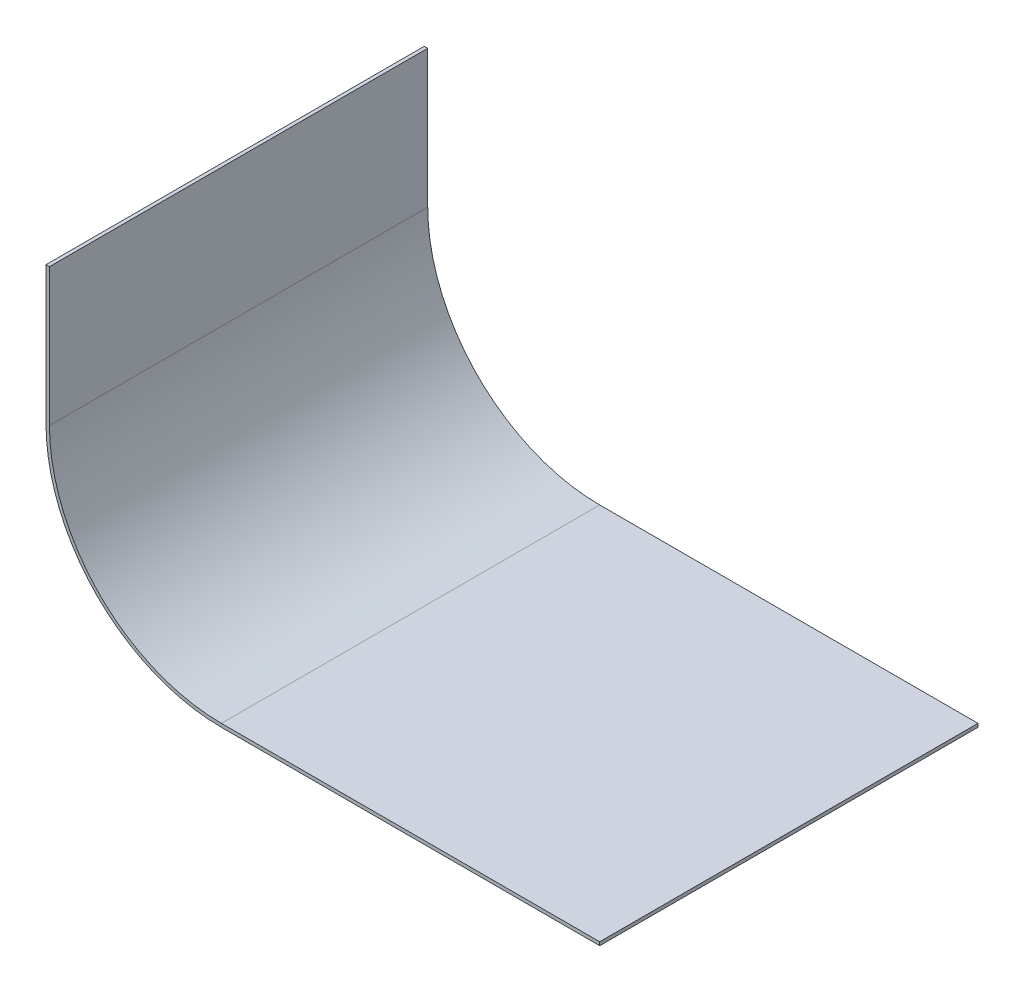
ISO-10303-21;
HEADER;
FILE_DESCRIPTION(('STEP AP214'),'2;1');
FILE_NAME('part.step','',(''),(''),'','','');
FILE_SCHEMA(('AUTOMOTIVE_DESIGN { 1 0 10303 214 1 1 1 1 }'));
ENDSEC;
DATA;
#1=APPLICATION_CONTEXT('core data for automotive mechanical design processes');
#2=APPLICATION_PROTOCOL_DEFINITION('international standard','automotive_design',2000,#1);
#3=PRODUCT_CONTEXT('',#1,'mechanical');
#4=PRODUCT('Part','Part','',(#3));
#5=PRODUCT_RELATED_PRODUCT_CATEGORY('part','',(#4));
#6=PRODUCT_DEFINITION_FORMATION('','',#4);
#7=PRODUCT_DEFINITION_CONTEXT('part definition',#1,'design');
#8=PRODUCT_DEFINITION('design','',#6,#7);
#9=PRODUCT_DEFINITION_SHAPE('','',#8);
#10=(LENGTH_UNIT() NAMED_UNIT(*) SI_UNIT(.MILLI.,.METRE.));
#11=(NAMED_UNIT(*) PLANE_ANGLE_UNIT() SI_UNIT($,.RADIAN.));
#12=(NAMED_UNIT(*) SI_UNIT($,.STERADIAN.) SOLID_ANGLE_UNIT());
#13=UNCERTAINTY_MEASURE_WITH_UNIT(LENGTH_MEASURE(1.E-05),#10,'distance_accuracy_value','');
#14=(GEOMETRIC_REPRESENTATION_CONTEXT(3) GLOBAL_UNCERTAINTY_ASSIGNED_CONTEXT((#13)) GLOBAL_UNIT_ASSIGNED_CONTEXT((#10,
#11,#12)) REPRESENTATION_CONTEXT('',''));
#15=CARTESIAN_POINT('',(0.,0.,0.));
#16=DIRECTION('',(0.,0.,1.));
#17=DIRECTION('',(1.,0.,0.));
#18=AXIS2_PLACEMENT_3D('',#15,#16,#17);
#19=CARTESIAN_POINT('',(-0.1,0.,11.));
#20=DIRECTION('',(0.,-1.,0.));
#21=DIRECTION('',(0.,0.,-1.));
#22=AXIS2_PLACEMENT_3D('',#19,#20,#21);
#23=PLANE('',#22);
#24=DIRECTION('',(-1.,0.,0.));
#25=VECTOR('',#24,1.);
#26=CARTESIAN_POINT('',(-0.1,0.,0.));
#27=LINE('',#26,#25);
#28=CARTESIAN_POINT('',(0.,0.,0.));
#29=VERTEX_POINT('',#28);
#30=CARTESIAN_POINT('',(-0.1,0.,0.));
#31=VERTEX_POINT('',#30);
#32=EDGE_CURVE('E127',#29,#31,#27,.T.);
#33=ORIENTED_EDGE('',*,*,#32,.T.);
#34=DIRECTION('',(0.,0.,-1.));
#35=VECTOR('',#34,1.);
#36=CARTESIAN_POINT('',(-0.1,0.,11.));
#37=LINE('',#36,#35);
#38=CARTESIAN_POINT('',(-0.1,0.,11.));
#39=VERTEX_POINT('',#38);
#40=EDGE_CURVE('E11',#39,#31,#37,.T.);
#41=ORIENTED_EDGE('',*,*,#40,.F.);
#42=DIRECTION('',(-1.,0.,0.));
#43=VECTOR('',#42,1.);
#44=CARTESIAN_POINT('',(-0.1,0.,11.));
#45=LINE('',#44,#43);
#46=CARTESIAN_POINT('',(0.,0.,11.));
#47=VERTEX_POINT('',#46);
#48=EDGE_CURVE('E141',#47,#39,#45,.T.);
#49=ORIENTED_EDGE('',*,*,#48,.F.);
#50=DIRECTION('',(0.,0.,-1.));
#51=VECTOR('',#50,1.);
#52=CARTESIAN_POINT('',(0.,0.,11.));
#53=LINE('',#52,#51);
#54=EDGE_CURVE('E123',#47,#29,#53,.T.);
#55=ORIENTED_EDGE('',*,*,#54,.T.);
#56=EDGE_LOOP('',(#33,#41,#49,#55));
#57=FACE_BOUND('',#56,.T.);
#58=ADVANCED_FACE('F31',(#57),#23,.F.);
#59=CARTESIAN_POINT('',(-0.1,0.,11.));
#60=DIRECTION('',(1.,0.,0.));
#61=DIRECTION('',(0.,0.,-1.));
#62=AXIS2_PLACEMENT_3D('',#59,#60,#61);
#63=PLANE('',#62);
#64=DIRECTION('',(0.,-1.,0.));
#65=VECTOR('',#64,1.);
#66=CARTESIAN_POINT('',(-0.1,0.,0.));
#67=LINE('',#66,#65);
#68=CARTESIAN_POINT('',(-0.1,-4.,0.));
#69=VERTEX_POINT('',#68);
#70=EDGE_CURVE('E130',#31,#69,#67,.T.);
#71=ORIENTED_EDGE('',*,*,#70,.T.);
#72=DIRECTION('',(0.,0.,-1.));
#73=VECTOR('',#72,1.);
#74=CARTESIAN_POINT('',(-0.1,-4.,11.));
#75=LINE('',#74,#73);
#76=CARTESIAN_POINT('',(-0.1,-4.,11.));
#77=VERTEX_POINT('',#76);
#78=EDGE_CURVE('E39',#77,#69,#75,.T.);
#79=ORIENTED_EDGE('',*,*,#78,.F.);
#80=DIRECTION('',(0.,-1.,0.));
#81=VECTOR('',#80,1.);
#82=CARTESIAN_POINT('',(-0.1,0.,11.));
#83=LINE('',#82,#81);
#84=EDGE_CURVE('E90',#39,#77,#83,.T.);
#85=ORIENTED_EDGE('',*,*,#84,.F.);
#86=ORIENTED_EDGE('',*,*,#40,.T.);
#87=EDGE_LOOP('',(#71,#79,#85,#86));
#88=FACE_BOUND('',#87,.T.);
#89=ADVANCED_FACE('F176',(#88),#63,.F.);
#90=CARTESIAN_POINT('',(5.,-4.,11.));
#91=DIRECTION('',(0.,0.,-1.));
#92=DIRECTION('',(-1.,0.,0.));
#93=AXIS2_PLACEMENT_3D('',#90,#91,#92);
#94=CYLINDRICAL_SURFACE('',#93,5.1);
#95=CARTESIAN_POINT('',(5.,-4.,0.));
#96=DIRECTION('',(0.,0.,1.));
#97=DIRECTION('',(1.,0.,0.));
#98=AXIS2_PLACEMENT_3D('',#95,#96,#97);
#99=CIRCLE('',#98,5.1);
#100=CARTESIAN_POINT('',(5.,-9.1,0.));
#101=VERTEX_POINT('',#100);
#102=EDGE_CURVE('E132',#69,#101,#99,.T.);
#103=ORIENTED_EDGE('',*,*,#102,.T.);
#104=DIRECTION('',(0.,0.,-1.));
#105=VECTOR('',#104,1.);
#106=CARTESIAN_POINT('',(5.,-9.1,11.));
#107=LINE('',#106,#105);
#108=CARTESIAN_POINT('',(5.,-9.1,11.));
#109=VERTEX_POINT('',#108);
#110=EDGE_CURVE('E148',#109,#101,#107,.T.);
#111=ORIENTED_EDGE('',*,*,#110,.F.);
#112=CARTESIAN_POINT('',(5.,-4.,11.));
#113=DIRECTION('',(0.,0.,1.));
#114=DIRECTION('',(1.,0.,0.));
#115=AXIS2_PLACEMENT_3D('',#112,#113,#114);
#116=CIRCLE('',#115,5.1);
#117=EDGE_CURVE('E156',#77,#109,#116,.T.);
#118=ORIENTED_EDGE('',*,*,#117,.F.);
#119=ORIENTED_EDGE('',*,*,#78,.T.);
#120=EDGE_LOOP('',(#103,#111,#118,#119));
#121=FACE_BOUND('',#120,.T.);
#122=ADVANCED_FACE('F154',(#121),#94,.T.);
#123=CARTESIAN_POINT('',(5.,-9.1,11.));
#124=DIRECTION('',(0.,1.,0.));
#125=DIRECTION('',(-1.,0.,0.));
#126=AXIS2_PLACEMENT_3D('',#123,#124,#125);
#127=PLANE('',#126);
#128=DIRECTION('',(1.,0.,0.));
#129=VECTOR('',#128,1.);
#130=CARTESIAN_POINT('',(5.,-9.1,0.));
#131=LINE('',#130,#129);
#132=CARTESIAN_POINT('',(16.,-9.09999999999999,0.));
#133=VERTEX_POINT('',#132);
#134=EDGE_CURVE('E134',#101,#133,#131,.T.);
#135=ORIENTED_EDGE('',*,*,#134,.T.);
#136=DIRECTION('',(0.,0.,-1.));
#137=VECTOR('',#136,1.);
#138=CARTESIAN_POINT('',(16.,-9.09999999999999,11.));
#139=LINE('',#138,#137);
#140=CARTESIAN_POINT('',(16.,-9.09999999999999,11.));
#141=VERTEX_POINT('',#140);
#142=EDGE_CURVE('E145',#141,#133,#139,.T.);
#143=ORIENTED_EDGE('',*,*,#142,.F.);
#144=DIRECTION('',(1.,0.,0.));
#145=VECTOR('',#144,1.);
#146=CARTESIAN_POINT('',(5.,-9.1,11.));
#147=LINE('',#146,#145);
#148=EDGE_CURVE('E168',#109,#141,#147,.T.);
#149=ORIENTED_EDGE('',*,*,#148,.F.);
#150=ORIENTED_EDGE('',*,*,#110,.T.);
#151=EDGE_LOOP('',(#135,#143,#149,#150));
#152=FACE_BOUND('',#151,.T.);
#153=ADVANCED_FACE('F164',(#152),#127,.F.);
#154=CARTESIAN_POINT('',(16.,-9.,11.));
#155=DIRECTION('',(-1.,0.,0.));
#156=DIRECTION('',(0.,0.,1.));
#157=AXIS2_PLACEMENT_3D('',#154,#155,#156);
#158=PLANE('',#157);
#159=DIRECTION('',(0.,1.,0.));
#160=VECTOR('',#159,1.);
#161=CARTESIAN_POINT('',(16.,-9.,0.));
#162=LINE('',#161,#160);
#163=CARTESIAN_POINT('',(16.,-9.,0.));
#164=VERTEX_POINT('',#163);
#165=EDGE_CURVE('E136',#133,#164,#162,.T.);
#166=ORIENTED_EDGE('',*,*,#165,.T.);
#167=DIRECTION('',(0.,0.,-1.));
#168=VECTOR('',#167,1.);
#169=CARTESIAN_POINT('',(16.,-9.,11.));
#170=LINE('',#169,#168);
#171=CARTESIAN_POINT('',(16.,-9.,11.));
#172=VERTEX_POINT('',#171);
#173=EDGE_CURVE('E118',#172,#164,#170,.T.);
#174=ORIENTED_EDGE('',*,*,#173,.F.);
#175=DIRECTION('',(0.,1.,0.));
#176=VECTOR('',#175,1.);
#177=CARTESIAN_POINT('',(16.,-9.,11.));
#178=LINE('',#177,#176);
#179=EDGE_CURVE('E109',#141,#172,#178,.T.);
#180=ORIENTED_EDGE('',*,*,#179,.F.);
#181=ORIENTED_EDGE('',*,*,#142,.T.);
#182=EDGE_LOOP('',(#166,#174,#180,#181));
#183=FACE_BOUND('',#182,.T.);
#184=ADVANCED_FACE('F167',(#183),#158,.F.);
#185=CARTESIAN_POINT('',(5.,-8.99999999999999,11.));
#186=DIRECTION('',(0.,-1.,0.));
#187=DIRECTION('',(1.,0.,0.));
#188=AXIS2_PLACEMENT_3D('',#185,#186,#187);
#189=PLANE('',#188);
#190=DIRECTION('',(-1.,0.,0.));
#191=VECTOR('',#190,1.);
#192=CARTESIAN_POINT('',(5.,-8.99999999999999,0.));
#193=LINE('',#192,#191);
#194=CARTESIAN_POINT('',(5.,-8.99999999999999,0.));
#195=VERTEX_POINT('',#194);
#196=EDGE_CURVE('E117',#164,#195,#193,.T.);
#197=ORIENTED_EDGE('',*,*,#196,.T.);
#198=DIRECTION('',(0.,0.,-1.));
#199=VECTOR('',#198,1.);
#200=CARTESIAN_POINT('',(5.,-8.99999999999999,11.));
#201=LINE('',#200,#199);
#202=CARTESIAN_POINT('',(5.,-8.99999999999999,11.));
#203=VERTEX_POINT('',#202);
#204=EDGE_CURVE('E114',#203,#195,#201,.T.);
#205=ORIENTED_EDGE('',*,*,#204,.F.);
#206=DIRECTION('',(-1.,0.,0.));
#207=VECTOR('',#206,1.);
#208=CARTESIAN_POINT('',(5.,-8.99999999999999,11.));
#209=LINE('',#208,#207);
#210=EDGE_CURVE('E103',#172,#203,#209,.T.);
#211=ORIENTED_EDGE('',*,*,#210,.F.);
#212=ORIENTED_EDGE('',*,*,#173,.T.);
#213=EDGE_LOOP('',(#197,#205,#211,#212));
#214=FACE_BOUND('',#213,.T.);
#215=ADVANCED_FACE('F115',(#214),#189,.F.);
#216=CARTESIAN_POINT('',(5.,-4.,11.));
#217=DIRECTION('',(0.,0.,-1.));
#218=DIRECTION('',(-1.,0.,0.));
#219=AXIS2_PLACEMENT_3D('',#216,#217,#218);
#220=CYLINDRICAL_SURFACE('',#219,5.);
#221=CARTESIAN_POINT('',(5.,-4.,0.));
#222=DIRECTION('',(0.,0.,-1.));
#223=DIRECTION('',(1.,0.,0.));
#224=AXIS2_PLACEMENT_3D('',#221,#222,#223);
#225=CIRCLE('',#224,5.);
#226=CARTESIAN_POINT('',(0.,-4.,0.));
#227=VERTEX_POINT('',#226);
#228=EDGE_CURVE('E76',#195,#227,#225,.T.);
#229=ORIENTED_EDGE('',*,*,#228,.T.);
#230=DIRECTION('',(0.,0.,-1.));
#231=VECTOR('',#230,1.);
#232=CARTESIAN_POINT('',(0.,-4.,11.));
#233=LINE('',#232,#231);
#234=CARTESIAN_POINT('',(0.,-4.,11.));
#235=VERTEX_POINT('',#234);
#236=EDGE_CURVE('E119',#235,#227,#233,.T.);
#237=ORIENTED_EDGE('',*,*,#236,.F.);
#238=CARTESIAN_POINT('',(5.,-4.,11.));
#239=DIRECTION('',(0.,0.,-1.));
#240=DIRECTION('',(1.,0.,0.));
#241=AXIS2_PLACEMENT_3D('',#238,#239,#240);
#242=CIRCLE('',#241,5.);
#243=EDGE_CURVE('E107',#203,#235,#242,.T.);
#244=ORIENTED_EDGE('',*,*,#243,.F.);
#245=ORIENTED_EDGE('',*,*,#204,.T.);
#246=EDGE_LOOP('',(#229,#237,#244,#245));
#247=FACE_BOUND('',#246,.T.);
#248=ADVANCED_FACE('F121',(#247),#220,.F.);
#249=CARTESIAN_POINT('',(0.,0.,11.));
#250=DIRECTION('',(-1.,0.,0.));
#251=DIRECTION('',(0.,-1.,0.));
#252=AXIS2_PLACEMENT_3D('',#249,#250,#251);
#253=PLANE('',#252);
#254=DIRECTION('',(0.,1.,0.));
#255=VECTOR('',#254,1.);
#256=CARTESIAN_POINT('',(0.,0.,0.));
#257=LINE('',#256,#255);
#258=EDGE_CURVE('E82',#227,#29,#257,.T.);
#259=ORIENTED_EDGE('',*,*,#258,.T.);
#260=ORIENTED_EDGE('',*,*,#54,.F.);
#261=DIRECTION('',(0.,1.,0.));
#262=VECTOR('',#261,1.);
#263=CARTESIAN_POINT('',(0.,0.,11.));
#264=LINE('',#263,#262);
#265=EDGE_CURVE('E47',#235,#47,#264,.T.);
#266=ORIENTED_EDGE('',*,*,#265,.F.);
#267=ORIENTED_EDGE('',*,*,#236,.T.);
#268=EDGE_LOOP('',(#259,#260,#266,#267));
#269=FACE_BOUND('',#268,.T.);
#270=ADVANCED_FACE('F192',(#269),#253,.F.);
#271=CARTESIAN_POINT('',(5.,-4.,11.));
#272=DIRECTION('',(0.,0.,1.));
#273=DIRECTION('',(1.,0.,0.));
#274=AXIS2_PLACEMENT_3D('',#271,#272,#273);
#275=PLANE('',#274);
#276=ORIENTED_EDGE('',*,*,#48,.T.);
#277=ORIENTED_EDGE('',*,*,#84,.T.);
#278=ORIENTED_EDGE('',*,*,#117,.T.);
#279=ORIENTED_EDGE('',*,*,#148,.T.);
#280=ORIENTED_EDGE('',*,*,#179,.T.);
#281=ORIENTED_EDGE('',*,*,#210,.T.);
#282=ORIENTED_EDGE('',*,*,#243,.T.);
#283=ORIENTED_EDGE('',*,*,#265,.T.);
#284=EDGE_LOOP('',(#276,#277,#278,#279,#280,#281,#282,#283));
#285=FACE_BOUND('',#284,.T.);
#286=ADVANCED_FACE('F105',(#285),#275,.T.);
#287=CARTESIAN_POINT('',(5.,-4.,0.));
#288=DIRECTION('',(0.,0.,1.));
#289=DIRECTION('',(1.,0.,0.));
#290=AXIS2_PLACEMENT_3D('',#287,#288,#289);
#291=PLANE('',#290);
#292=ORIENTED_EDGE('',*,*,#32,.F.);
#293=ORIENTED_EDGE('',*,*,#258,.F.);
#294=ORIENTED_EDGE('',*,*,#228,.F.);
#295=ORIENTED_EDGE('',*,*,#196,.F.);
#296=ORIENTED_EDGE('',*,*,#165,.F.);
#297=ORIENTED_EDGE('',*,*,#134,.F.);
#298=ORIENTED_EDGE('',*,*,#102,.F.);
#299=ORIENTED_EDGE('',*,*,#70,.F.);
#300=EDGE_LOOP('',(#292,#293,#294,#295,#296,#297,#298,#299));
#301=FACE_BOUND('',#300,.T.);
#302=ADVANCED_FACE('F160',(#301),#291,.F.);
#303=CLOSED_SHELL('',(#58,#89,#122,#153,#184,#215,#248,#270,#286,#302));
#304=MANIFOLD_SOLID_BREP('B2',#303);
#305=ADVANCED_BREP_SHAPE_REPRESENTATION('',(#18,#304),#14);
#306=SHAPE_DEFINITION_REPRESENTATION(#9,#305);
ENDSEC;
END-ISO-10303-21;
